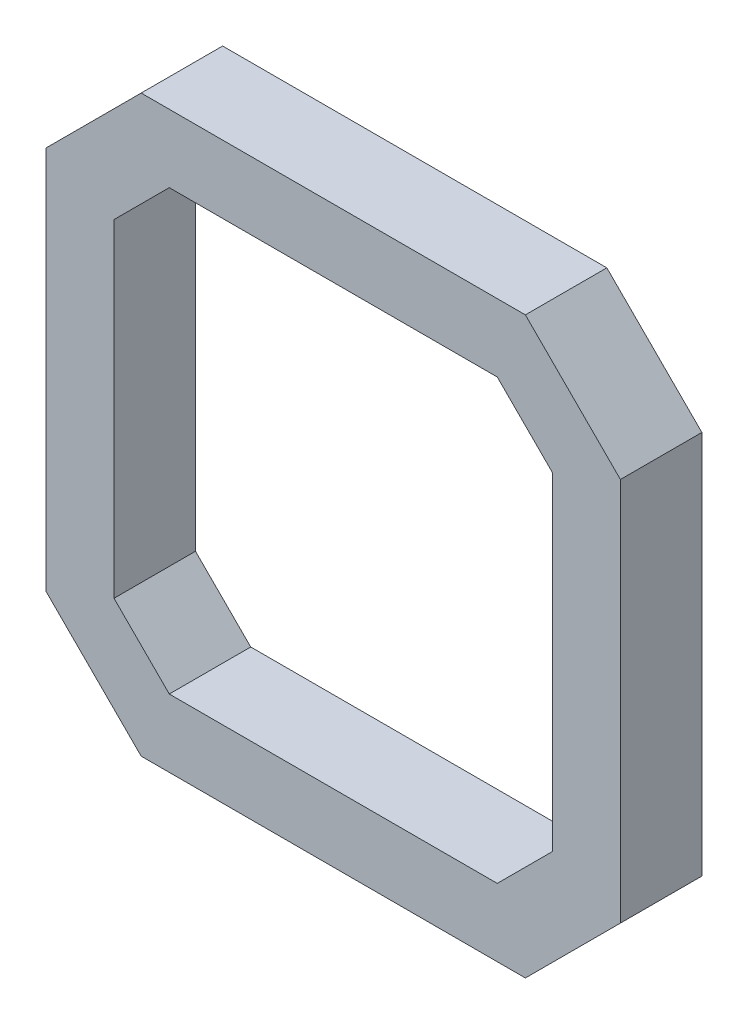
ISO-10303-21;
HEADER;
FILE_DESCRIPTION(('STEP AP214'),'2;1');
FILE_NAME('part.step','',(''),(''),'','','');
FILE_SCHEMA(('AUTOMOTIVE_DESIGN { 1 0 10303 214 1 1 1 1 }'));
ENDSEC;
DATA;
#1=APPLICATION_CONTEXT('core data for automotive mechanical design processes');
#2=APPLICATION_PROTOCOL_DEFINITION('international standard','automotive_design',2000,#1);
#3=PRODUCT_CONTEXT('',#1,'mechanical');
#4=PRODUCT('Part','Part','',(#3));
#5=PRODUCT_RELATED_PRODUCT_CATEGORY('part','',(#4));
#6=PRODUCT_DEFINITION_FORMATION('','',#4);
#7=PRODUCT_DEFINITION_CONTEXT('part definition',#1,'design');
#8=PRODUCT_DEFINITION('design','',#6,#7);
#9=PRODUCT_DEFINITION_SHAPE('','',#8);
#10=(LENGTH_UNIT() NAMED_UNIT(*) SI_UNIT(.MILLI.,.METRE.));
#11=(NAMED_UNIT(*) PLANE_ANGLE_UNIT() SI_UNIT($,.RADIAN.));
#12=(NAMED_UNIT(*) SI_UNIT($,.STERADIAN.) SOLID_ANGLE_UNIT());
#13=UNCERTAINTY_MEASURE_WITH_UNIT(LENGTH_MEASURE(1.E-05),#10,'distance_accuracy_value','');
#14=(GEOMETRIC_REPRESENTATION_CONTEXT(3) GLOBAL_UNCERTAINTY_ASSIGNED_CONTEXT((#13)) GLOBAL_UNIT_ASSIGNED_CONTEXT((#10,
#11,#12)) REPRESENTATION_CONTEXT('',''));
#15=CARTESIAN_POINT('',(0.,0.,0.));
#16=DIRECTION('',(0.,0.,1.));
#17=DIRECTION('',(1.,0.,0.));
#18=AXIS2_PLACEMENT_3D('',#15,#16,#17);
#19=CARTESIAN_POINT('',(0.,0.,6.));
#20=DIRECTION('',(0.,0.,-1.));
#21=DIRECTION('',(-1.,0.,0.));
#22=AXIS2_PLACEMENT_3D('',#19,#20,#21);
#23=PLANE('',#22);
#24=DIRECTION('',(0.,-1.,0.));
#25=VECTOR('',#24,1.);
#26=CARTESIAN_POINT('',(-21.15,-14.15,6.));
#27=LINE('',#26,#25);
#28=CARTESIAN_POINT('',(-21.15,14.15,6.));
#29=VERTEX_POINT('',#28);
#30=CARTESIAN_POINT('',(-21.15,-14.15,6.));
#31=VERTEX_POINT('',#30);
#32=EDGE_CURVE('E210',#29,#31,#27,.T.);
#33=ORIENTED_EDGE('',*,*,#32,.T.);
#34=DIRECTION('',(0.707106781186547,-0.707106781186547,0.));
#35=VECTOR('',#34,1.);
#36=CARTESIAN_POINT('',(-21.15,-14.15,6.));
#37=LINE('',#36,#35);
#38=CARTESIAN_POINT('',(-14.15,-21.15,6.));
#39=VERTEX_POINT('',#38);
#40=EDGE_CURVE('E213',#31,#39,#37,.T.);
#41=ORIENTED_EDGE('',*,*,#40,.T.);
#42=DIRECTION('',(1.,0.,0.));
#43=VECTOR('',#42,1.);
#44=CARTESIAN_POINT('',(-14.15,-21.15,6.));
#45=LINE('',#44,#43);
#46=CARTESIAN_POINT('',(14.15,-21.15,6.));
#47=VERTEX_POINT('',#46);
#48=EDGE_CURVE('E216',#39,#47,#45,.T.);
#49=ORIENTED_EDGE('',*,*,#48,.T.);
#50=DIRECTION('',(0.707106781186547,0.707106781186547,0.));
#51=VECTOR('',#50,1.);
#52=CARTESIAN_POINT('',(14.15,-21.15,6.));
#53=LINE('',#52,#51);
#54=CARTESIAN_POINT('',(21.15,-14.15,6.));
#55=VERTEX_POINT('',#54);
#56=EDGE_CURVE('E218',#47,#55,#53,.T.);
#57=ORIENTED_EDGE('',*,*,#56,.T.);
#58=DIRECTION('',(0.,1.,0.));
#59=VECTOR('',#58,1.);
#60=CARTESIAN_POINT('',(21.15,-14.15,6.));
#61=LINE('',#60,#59);
#62=CARTESIAN_POINT('',(21.15,14.15,6.));
#63=VERTEX_POINT('',#62);
#64=EDGE_CURVE('E220',#55,#63,#61,.T.);
#65=ORIENTED_EDGE('',*,*,#64,.T.);
#66=DIRECTION('',(-0.707106781186547,0.707106781186547,0.));
#67=VECTOR('',#66,1.);
#68=CARTESIAN_POINT('',(14.15,21.15,6.));
#69=LINE('',#68,#67);
#70=CARTESIAN_POINT('',(14.15,21.15,6.));
#71=VERTEX_POINT('',#70);
#72=EDGE_CURVE('E222',#63,#71,#69,.T.);
#73=ORIENTED_EDGE('',*,*,#72,.T.);
#74=DIRECTION('',(-1.,0.,0.));
#75=VECTOR('',#74,1.);
#76=CARTESIAN_POINT('',(-14.15,21.15,6.));
#77=LINE('',#76,#75);
#78=CARTESIAN_POINT('',(-14.15,21.15,6.));
#79=VERTEX_POINT('',#78);
#80=EDGE_CURVE('E224',#71,#79,#77,.T.);
#81=ORIENTED_EDGE('',*,*,#80,.T.);
#82=DIRECTION('',(-0.707106781186547,-0.707106781186547,0.));
#83=VECTOR('',#82,1.);
#84=CARTESIAN_POINT('',(-21.15,14.15,6.));
#85=LINE('',#84,#83);
#86=EDGE_CURVE('E226',#79,#29,#85,.T.);
#87=ORIENTED_EDGE('',*,*,#86,.T.);
#88=EDGE_LOOP('',(#33,#41,#49,#57,#65,#73,#81,#87));
#89=FACE_BOUND('',#88,.T.);
#90=DIRECTION('',(-0.707106781186547,-0.707106781186547,0.));
#91=VECTOR('',#90,1.);
#92=CARTESIAN_POINT('',(-16.15,12.0789321881345,6.));
#93=LINE('',#92,#91);
#94=CARTESIAN_POINT('',(-12.0789321881345,16.15,6.));
#95=VERTEX_POINT('',#94);
#96=CARTESIAN_POINT('',(-16.15,12.0789321881345,6.));
#97=VERTEX_POINT('',#96);
#98=EDGE_CURVE('E145',#95,#97,#93,.T.);
#99=ORIENTED_EDGE('',*,*,#98,.F.);
#100=DIRECTION('',(-1.,0.,0.));
#101=VECTOR('',#100,1.);
#102=CARTESIAN_POINT('',(-12.0789321881345,16.15,6.));
#103=LINE('',#102,#101);
#104=CARTESIAN_POINT('',(12.0789321881345,16.15,6.));
#105=VERTEX_POINT('',#104);
#106=EDGE_CURVE('E178',#105,#95,#103,.T.);
#107=ORIENTED_EDGE('',*,*,#106,.F.);
#108=DIRECTION('',(-0.707106781186547,0.707106781186547,0.));
#109=VECTOR('',#108,1.);
#110=CARTESIAN_POINT('',(12.0789321881345,16.15,6.));
#111=LINE('',#110,#109);
#112=CARTESIAN_POINT('',(16.15,12.0789321881345,6.));
#113=VERTEX_POINT('',#112);
#114=EDGE_CURVE('E176',#113,#105,#111,.T.);
#115=ORIENTED_EDGE('',*,*,#114,.F.);
#116=DIRECTION('',(0.,1.,0.));
#117=VECTOR('',#116,1.);
#118=CARTESIAN_POINT('',(16.15,-12.0789321881345,6.));
#119=LINE('',#118,#117);
#120=CARTESIAN_POINT('',(16.15,-12.0789321881345,6.));
#121=VERTEX_POINT('',#120);
#122=EDGE_CURVE('E174',#121,#113,#119,.T.);
#123=ORIENTED_EDGE('',*,*,#122,.F.);
#124=DIRECTION('',(0.707106781186547,0.707106781186547,0.));
#125=VECTOR('',#124,1.);
#126=CARTESIAN_POINT('',(12.0789321881345,-16.15,6.));
#127=LINE('',#126,#125);
#128=CARTESIAN_POINT('',(12.0789321881345,-16.15,6.));
#129=VERTEX_POINT('',#128);
#130=EDGE_CURVE('E172',#129,#121,#127,.T.);
#131=ORIENTED_EDGE('',*,*,#130,.F.);
#132=DIRECTION('',(1.,0.,0.));
#133=VECTOR('',#132,1.);
#134=CARTESIAN_POINT('',(-12.0789321881345,-16.15,6.));
#135=LINE('',#134,#133);
#136=CARTESIAN_POINT('',(-12.0789321881345,-16.15,6.));
#137=VERTEX_POINT('',#136);
#138=EDGE_CURVE('E168',#137,#129,#135,.T.);
#139=ORIENTED_EDGE('',*,*,#138,.F.);
#140=DIRECTION('',(0.707106781186547,-0.707106781186547,0.));
#141=VECTOR('',#140,1.);
#142=CARTESIAN_POINT('',(-16.15,-12.0789321881345,6.));
#143=LINE('',#142,#141);
#144=CARTESIAN_POINT('',(-16.15,-12.0789321881345,6.));
#145=VERTEX_POINT('',#144);
#146=EDGE_CURVE('E166',#145,#137,#143,.T.);
#147=ORIENTED_EDGE('',*,*,#146,.F.);
#148=DIRECTION('',(0.,-1.,0.));
#149=VECTOR('',#148,1.);
#150=CARTESIAN_POINT('',(-16.15,-12.0789321881345,6.));
#151=LINE('',#150,#149);
#152=EDGE_CURVE('E153',#97,#145,#151,.T.);
#153=ORIENTED_EDGE('',*,*,#152,.F.);
#154=EDGE_LOOP('',(#99,#107,#115,#123,#131,#139,#147,#153));
#155=FACE_BOUND('',#154,.T.);
#156=ADVANCED_FACE('F32',(#89,#155),#23,.F.);
#157=CARTESIAN_POINT('',(0.,0.,0.));
#158=DIRECTION('',(0.,0.,-1.));
#159=DIRECTION('',(-1.,0.,0.));
#160=AXIS2_PLACEMENT_3D('',#157,#158,#159);
#161=PLANE('',#160);
#162=DIRECTION('',(0.,-1.,0.));
#163=VECTOR('',#162,1.);
#164=CARTESIAN_POINT('',(-21.15,-14.15,0.));
#165=LINE('',#164,#163);
#166=CARTESIAN_POINT('',(-21.15,14.15,0.));
#167=VERTEX_POINT('',#166);
#168=CARTESIAN_POINT('',(-21.15,-14.15,0.));
#169=VERTEX_POINT('',#168);
#170=EDGE_CURVE('E161',#167,#169,#165,.T.);
#171=ORIENTED_EDGE('',*,*,#170,.F.);
#172=DIRECTION('',(-0.707106781186547,-0.707106781186547,0.));
#173=VECTOR('',#172,1.);
#174=CARTESIAN_POINT('',(-21.15,14.15,0.));
#175=LINE('',#174,#173);
#176=CARTESIAN_POINT('',(-14.15,21.15,0.));
#177=VERTEX_POINT('',#176);
#178=EDGE_CURVE('E214',#177,#167,#175,.T.);
#179=ORIENTED_EDGE('',*,*,#178,.F.);
#180=DIRECTION('',(-1.,0.,0.));
#181=VECTOR('',#180,1.);
#182=CARTESIAN_POINT('',(-14.15,21.15,0.));
#183=LINE('',#182,#181);
#184=CARTESIAN_POINT('',(14.15,21.15,0.));
#185=VERTEX_POINT('',#184);
#186=EDGE_CURVE('E241',#185,#177,#183,.T.);
#187=ORIENTED_EDGE('',*,*,#186,.F.);
#188=DIRECTION('',(-0.707106781186547,0.707106781186547,0.));
#189=VECTOR('',#188,1.);
#190=CARTESIAN_POINT('',(14.15,21.15,0.));
#191=LINE('',#190,#189);
#192=CARTESIAN_POINT('',(21.15,14.15,0.));
#193=VERTEX_POINT('',#192);
#194=EDGE_CURVE('E239',#193,#185,#191,.T.);
#195=ORIENTED_EDGE('',*,*,#194,.F.);
#196=DIRECTION('',(0.,1.,0.));
#197=VECTOR('',#196,1.);
#198=CARTESIAN_POINT('',(21.15,-14.15,0.));
#199=LINE('',#198,#197);
#200=CARTESIAN_POINT('',(21.15,-14.15,0.));
#201=VERTEX_POINT('',#200);
#202=EDGE_CURVE('E237',#201,#193,#199,.T.);
#203=ORIENTED_EDGE('',*,*,#202,.F.);
#204=DIRECTION('',(0.707106781186547,0.707106781186547,0.));
#205=VECTOR('',#204,1.);
#206=CARTESIAN_POINT('',(14.15,-21.15,0.));
#207=LINE('',#206,#205);
#208=CARTESIAN_POINT('',(14.15,-21.15,0.));
#209=VERTEX_POINT('',#208);
#210=EDGE_CURVE('E235',#209,#201,#207,.T.);
#211=ORIENTED_EDGE('',*,*,#210,.F.);
#212=DIRECTION('',(1.,0.,0.));
#213=VECTOR('',#212,1.);
#214=CARTESIAN_POINT('',(-14.15,-21.15,0.));
#215=LINE('',#214,#213);
#216=CARTESIAN_POINT('',(-14.15,-21.15,0.));
#217=VERTEX_POINT('',#216);
#218=EDGE_CURVE('E233',#217,#209,#215,.T.);
#219=ORIENTED_EDGE('',*,*,#218,.F.);
#220=DIRECTION('',(0.707106781186547,-0.707106781186547,0.));
#221=VECTOR('',#220,1.);
#222=CARTESIAN_POINT('',(-21.15,-14.15,0.));
#223=LINE('',#222,#221);
#224=EDGE_CURVE('E231',#169,#217,#223,.T.);
#225=ORIENTED_EDGE('',*,*,#224,.F.);
#226=EDGE_LOOP('',(#171,#179,#187,#195,#203,#211,#219,#225));
#227=FACE_BOUND('',#226,.T.);
#228=DIRECTION('',(-1.,0.,0.));
#229=VECTOR('',#228,1.);
#230=CARTESIAN_POINT('',(-12.0789321881345,16.15,0.));
#231=LINE('',#230,#229);
#232=CARTESIAN_POINT('',(12.0789321881345,16.15,0.));
#233=VERTEX_POINT('',#232);
#234=CARTESIAN_POINT('',(-12.0789321881345,16.15,0.));
#235=VERTEX_POINT('',#234);
#236=EDGE_CURVE('E154',#233,#235,#231,.T.);
#237=ORIENTED_EDGE('',*,*,#236,.T.);
#238=DIRECTION('',(-0.707106781186547,-0.707106781186547,0.));
#239=VECTOR('',#238,1.);
#240=CARTESIAN_POINT('',(-16.15,12.0789321881345,0.));
#241=LINE('',#240,#239);
#242=CARTESIAN_POINT('',(-16.15,12.0789321881345,0.));
#243=VERTEX_POINT('',#242);
#244=EDGE_CURVE('E55',#235,#243,#241,.T.);
#245=ORIENTED_EDGE('',*,*,#244,.T.);
#246=DIRECTION('',(0.,-1.,0.));
#247=VECTOR('',#246,1.);
#248=CARTESIAN_POINT('',(-16.15,-12.0789321881345,0.));
#249=LINE('',#248,#247);
#250=CARTESIAN_POINT('',(-16.15,-12.0789321881345,0.));
#251=VERTEX_POINT('',#250);
#252=EDGE_CURVE('E160',#243,#251,#249,.T.);
#253=ORIENTED_EDGE('',*,*,#252,.T.);
#254=DIRECTION('',(0.707106781186547,-0.707106781186547,0.));
#255=VECTOR('',#254,1.);
#256=CARTESIAN_POINT('',(-16.15,-12.0789321881345,0.));
#257=LINE('',#256,#255);
#258=CARTESIAN_POINT('',(-12.0789321881345,-16.15,0.));
#259=VERTEX_POINT('',#258);
#260=EDGE_CURVE('E182',#251,#259,#257,.T.);
#261=ORIENTED_EDGE('',*,*,#260,.T.);
#262=DIRECTION('',(1.,0.,0.));
#263=VECTOR('',#262,1.);
#264=CARTESIAN_POINT('',(-12.0789321881345,-16.15,0.));
#265=LINE('',#264,#263);
#266=CARTESIAN_POINT('',(12.0789321881345,-16.15,0.));
#267=VERTEX_POINT('',#266);
#268=EDGE_CURVE('E185',#259,#267,#265,.T.);
#269=ORIENTED_EDGE('',*,*,#268,.T.);
#270=DIRECTION('',(0.707106781186547,0.707106781186547,0.));
#271=VECTOR('',#270,1.);
#272=CARTESIAN_POINT('',(12.0789321881345,-16.15,0.));
#273=LINE('',#272,#271);
#274=CARTESIAN_POINT('',(16.15,-12.0789321881345,0.));
#275=VERTEX_POINT('',#274);
#276=EDGE_CURVE('E188',#267,#275,#273,.T.);
#277=ORIENTED_EDGE('',*,*,#276,.T.);
#278=DIRECTION('',(0.,1.,0.));
#279=VECTOR('',#278,1.);
#280=CARTESIAN_POINT('',(16.15,-12.0789321881345,0.));
#281=LINE('',#280,#279);
#282=CARTESIAN_POINT('',(16.15,12.0789321881345,0.));
#283=VERTEX_POINT('',#282);
#284=EDGE_CURVE('E191',#275,#283,#281,.T.);
#285=ORIENTED_EDGE('',*,*,#284,.T.);
#286=DIRECTION('',(-0.707106781186547,0.707106781186547,0.));
#287=VECTOR('',#286,1.);
#288=CARTESIAN_POINT('',(12.0789321881345,16.15,0.));
#289=LINE('',#288,#287);
#290=EDGE_CURVE('E194',#283,#233,#289,.T.);
#291=ORIENTED_EDGE('',*,*,#290,.T.);
#292=EDGE_LOOP('',(#237,#245,#253,#261,#269,#277,#285,#291));
#293=FACE_BOUND('',#292,.T.);
#294=ADVANCED_FACE('F271',(#227,#293),#161,.T.);
#295=CARTESIAN_POINT('',(-21.15,-14.15,6.));
#296=DIRECTION('',(1.,0.,0.));
#297=DIRECTION('',(0.,0.,-1.));
#298=AXIS2_PLACEMENT_3D('',#295,#296,#297);
#299=PLANE('',#298);
#300=ORIENTED_EDGE('',*,*,#170,.T.);
#301=DIRECTION('',(0.,0.,-1.));
#302=VECTOR('',#301,1.);
#303=CARTESIAN_POINT('',(-21.15,-14.15,6.));
#304=LINE('',#303,#302);
#305=EDGE_CURVE('E11',#31,#169,#304,.T.);
#306=ORIENTED_EDGE('',*,*,#305,.F.);
#307=ORIENTED_EDGE('',*,*,#32,.F.);
#308=DIRECTION('',(0.,0.,-1.));
#309=VECTOR('',#308,1.);
#310=CARTESIAN_POINT('',(-21.15,14.15,6.));
#311=LINE('',#310,#309);
#312=EDGE_CURVE('E228',#29,#167,#311,.T.);
#313=ORIENTED_EDGE('',*,*,#312,.T.);
#314=EDGE_LOOP('',(#300,#306,#307,#313));
#315=FACE_BOUND('',#314,.T.);
#316=ADVANCED_FACE('F34',(#315),#299,.F.);
#317=CARTESIAN_POINT('',(-21.15,-14.15,6.));
#318=DIRECTION('',(0.707106781186548,0.707106781186548,0.));
#319=DIRECTION('',(-0.707106781186548,0.707106781186548,0.));
#320=AXIS2_PLACEMENT_3D('',#317,#318,#319);
#321=PLANE('',#320);
#322=ORIENTED_EDGE('',*,*,#224,.T.);
#323=DIRECTION('',(0.,0.,-1.));
#324=VECTOR('',#323,1.);
#325=CARTESIAN_POINT('',(-14.15,-21.15,6.));
#326=LINE('',#325,#324);
#327=EDGE_CURVE('E40',#39,#217,#326,.T.);
#328=ORIENTED_EDGE('',*,*,#327,.F.);
#329=ORIENTED_EDGE('',*,*,#40,.F.);
#330=ORIENTED_EDGE('',*,*,#305,.T.);
#331=EDGE_LOOP('',(#322,#328,#329,#330));
#332=FACE_BOUND('',#331,.T.);
#333=ADVANCED_FACE('F288',(#332),#321,.F.);
#334=CARTESIAN_POINT('',(-14.15,-21.15,6.));
#335=DIRECTION('',(0.,1.,0.));
#336=DIRECTION('',(0.,0.,1.));
#337=AXIS2_PLACEMENT_3D('',#334,#335,#336);
#338=PLANE('',#337);
#339=ORIENTED_EDGE('',*,*,#218,.T.);
#340=DIRECTION('',(0.,0.,-1.));
#341=VECTOR('',#340,1.);
#342=CARTESIAN_POINT('',(14.15,-21.15,6.));
#343=LINE('',#342,#341);
#344=EDGE_CURVE('E258',#47,#209,#343,.T.);
#345=ORIENTED_EDGE('',*,*,#344,.F.);
#346=ORIENTED_EDGE('',*,*,#48,.F.);
#347=ORIENTED_EDGE('',*,*,#327,.T.);
#348=EDGE_LOOP('',(#339,#345,#346,#347));
#349=FACE_BOUND('',#348,.T.);
#350=ADVANCED_FACE('F265',(#349),#338,.F.);
#351=CARTESIAN_POINT('',(14.15,-21.15,6.));
#352=DIRECTION('',(-0.707106781186548,0.707106781186548,0.));
#353=DIRECTION('',(-0.707106781186548,-0.707106781186548,0.));
#354=AXIS2_PLACEMENT_3D('',#351,#352,#353);
#355=PLANE('',#354);
#356=ORIENTED_EDGE('',*,*,#210,.T.);
#357=DIRECTION('',(0.,0.,-1.));
#358=VECTOR('',#357,1.);
#359=CARTESIAN_POINT('',(21.15,-14.15,6.));
#360=LINE('',#359,#358);
#361=EDGE_CURVE('E255',#55,#201,#360,.T.);
#362=ORIENTED_EDGE('',*,*,#361,.F.);
#363=ORIENTED_EDGE('',*,*,#56,.F.);
#364=ORIENTED_EDGE('',*,*,#344,.T.);
#365=EDGE_LOOP('',(#356,#362,#363,#364));
#366=FACE_BOUND('',#365,.T.);
#367=ADVANCED_FACE('F277',(#366),#355,.F.);
#368=CARTESIAN_POINT('',(21.15,-14.15,6.));
#369=DIRECTION('',(-1.,0.,0.));
#370=DIRECTION('',(0.,0.,1.));
#371=AXIS2_PLACEMENT_3D('',#368,#369,#370);
#372=PLANE('',#371);
#373=ORIENTED_EDGE('',*,*,#202,.T.);
#374=DIRECTION('',(0.,0.,-1.));
#375=VECTOR('',#374,1.);
#376=CARTESIAN_POINT('',(21.15,14.15,6.));
#377=LINE('',#376,#375);
#378=EDGE_CURVE('E252',#63,#193,#377,.T.);
#379=ORIENTED_EDGE('',*,*,#378,.F.);
#380=ORIENTED_EDGE('',*,*,#64,.F.);
#381=ORIENTED_EDGE('',*,*,#361,.T.);
#382=EDGE_LOOP('',(#373,#379,#380,#381));
#383=FACE_BOUND('',#382,.T.);
#384=ADVANCED_FACE('F281',(#383),#372,.F.);
#385=CARTESIAN_POINT('',(14.15,21.15,6.));
#386=DIRECTION('',(-0.707106781186548,-0.707106781186548,0.));
#387=DIRECTION('',(0.707106781186548,-0.707106781186548,0.));
#388=AXIS2_PLACEMENT_3D('',#385,#386,#387);
#389=PLANE('',#388);
#390=ORIENTED_EDGE('',*,*,#194,.T.);
#391=DIRECTION('',(0.,0.,-1.));
#392=VECTOR('',#391,1.);
#393=CARTESIAN_POINT('',(14.15,21.15,6.));
#394=LINE('',#393,#392);
#395=EDGE_CURVE('E249',#71,#185,#394,.T.);
#396=ORIENTED_EDGE('',*,*,#395,.F.);
#397=ORIENTED_EDGE('',*,*,#72,.F.);
#398=ORIENTED_EDGE('',*,*,#378,.T.);
#399=EDGE_LOOP('',(#390,#396,#397,#398));
#400=FACE_BOUND('',#399,.T.);
#401=ADVANCED_FACE('F301',(#400),#389,.F.);
#402=CARTESIAN_POINT('',(-14.15,21.15,6.));
#403=DIRECTION('',(0.,-1.,0.));
#404=DIRECTION('',(0.,0.,-1.));
#405=AXIS2_PLACEMENT_3D('',#402,#403,#404);
#406=PLANE('',#405);
#407=ORIENTED_EDGE('',*,*,#186,.T.);
#408=DIRECTION('',(0.,0.,-1.));
#409=VECTOR('',#408,1.);
#410=CARTESIAN_POINT('',(-14.15,21.15,6.));
#411=LINE('',#410,#409);
#412=EDGE_CURVE('E246',#79,#177,#411,.T.);
#413=ORIENTED_EDGE('',*,*,#412,.F.);
#414=ORIENTED_EDGE('',*,*,#80,.F.);
#415=ORIENTED_EDGE('',*,*,#395,.T.);
#416=EDGE_LOOP('',(#407,#413,#414,#415));
#417=FACE_BOUND('',#416,.T.);
#418=ADVANCED_FACE('F299',(#417),#406,.F.);
#419=CARTESIAN_POINT('',(-21.15,14.15,6.));
#420=DIRECTION('',(0.707106781186548,-0.707106781186548,0.));
#421=DIRECTION('',(0.707106781186548,0.707106781186548,0.));
#422=AXIS2_PLACEMENT_3D('',#419,#420,#421);
#423=PLANE('',#422);
#424=ORIENTED_EDGE('',*,*,#178,.T.);
#425=ORIENTED_EDGE('',*,*,#312,.F.);
#426=ORIENTED_EDGE('',*,*,#86,.F.);
#427=ORIENTED_EDGE('',*,*,#412,.T.);
#428=EDGE_LOOP('',(#424,#425,#426,#427));
#429=FACE_BOUND('',#428,.T.);
#430=ADVANCED_FACE('F294',(#429),#423,.F.);
#431=CARTESIAN_POINT('',(-16.15,12.0789321881345,6.));
#432=DIRECTION('',(0.707106781186548,-0.707106781186548,0.));
#433=DIRECTION('',(0.707106781186548,0.707106781186548,0.));
#434=AXIS2_PLACEMENT_3D('',#431,#432,#433);
#435=PLANE('',#434);
#436=ORIENTED_EDGE('',*,*,#244,.F.);
#437=DIRECTION('',(0.,0.,-1.));
#438=VECTOR('',#437,1.);
#439=CARTESIAN_POINT('',(-12.0789321881345,16.15,6.));
#440=LINE('',#439,#438);
#441=EDGE_CURVE('E149',#95,#235,#440,.T.);
#442=ORIENTED_EDGE('',*,*,#441,.F.);
#443=ORIENTED_EDGE('',*,*,#98,.T.);
#444=DIRECTION('',(0.,0.,-1.));
#445=VECTOR('',#444,1.);
#446=CARTESIAN_POINT('',(-16.15,12.0789321881345,6.));
#447=LINE('',#446,#445);
#448=EDGE_CURVE('E148',#97,#243,#447,.T.);
#449=ORIENTED_EDGE('',*,*,#448,.T.);
#450=EDGE_LOOP('',(#436,#442,#443,#449));
#451=FACE_BOUND('',#450,.T.);
#452=ADVANCED_FACE('F147',(#451),#435,.T.);
#453=CARTESIAN_POINT('',(-16.15,-12.0789321881345,6.));
#454=DIRECTION('',(1.,0.,0.));
#455=DIRECTION('',(0.,0.,-1.));
#456=AXIS2_PLACEMENT_3D('',#453,#454,#455);
#457=PLANE('',#456);
#458=ORIENTED_EDGE('',*,*,#252,.F.);
#459=ORIENTED_EDGE('',*,*,#448,.F.);
#460=ORIENTED_EDGE('',*,*,#152,.T.);
#461=DIRECTION('',(0.,0.,-1.));
#462=VECTOR('',#461,1.);
#463=CARTESIAN_POINT('',(-16.15,-12.0789321881345,6.));
#464=LINE('',#463,#462);
#465=EDGE_CURVE('E162',#145,#251,#464,.T.);
#466=ORIENTED_EDGE('',*,*,#465,.T.);
#467=EDGE_LOOP('',(#458,#459,#460,#466));
#468=FACE_BOUND('',#467,.T.);
#469=ADVANCED_FACE('F157',(#468),#457,.T.);
#470=CARTESIAN_POINT('',(-16.15,-12.0789321881345,6.));
#471=DIRECTION('',(0.707106781186548,0.707106781186548,0.));
#472=DIRECTION('',(-0.707106781186548,0.707106781186548,0.));
#473=AXIS2_PLACEMENT_3D('',#470,#471,#472);
#474=PLANE('',#473);
#475=ORIENTED_EDGE('',*,*,#260,.F.);
#476=ORIENTED_EDGE('',*,*,#465,.F.);
#477=ORIENTED_EDGE('',*,*,#146,.T.);
#478=DIRECTION('',(0.,0.,-1.));
#479=VECTOR('',#478,1.);
#480=CARTESIAN_POINT('',(-12.0789321881345,-16.15,6.));
#481=LINE('',#480,#479);
#482=EDGE_CURVE('E207',#137,#259,#481,.T.);
#483=ORIENTED_EDGE('',*,*,#482,.T.);
#484=EDGE_LOOP('',(#475,#476,#477,#483));
#485=FACE_BOUND('',#484,.T.);
#486=ADVANCED_FACE('F326',(#485),#474,.T.);
#487=CARTESIAN_POINT('',(-12.0789321881345,-16.15,6.));
#488=DIRECTION('',(0.,1.,0.));
#489=DIRECTION('',(0.,0.,1.));
#490=AXIS2_PLACEMENT_3D('',#487,#488,#489);
#491=PLANE('',#490);
#492=ORIENTED_EDGE('',*,*,#268,.F.);
#493=ORIENTED_EDGE('',*,*,#482,.F.);
#494=ORIENTED_EDGE('',*,*,#138,.T.);
#495=DIRECTION('',(0.,0.,-1.));
#496=VECTOR('',#495,1.);
#497=CARTESIAN_POINT('',(12.0789321881345,-16.15,6.));
#498=LINE('',#497,#496);
#499=EDGE_CURVE('E205',#129,#267,#498,.T.);
#500=ORIENTED_EDGE('',*,*,#499,.T.);
#501=EDGE_LOOP('',(#492,#493,#494,#500));
#502=FACE_BOUND('',#501,.T.);
#503=ADVANCED_FACE('F330',(#502),#491,.T.);
#504=CARTESIAN_POINT('',(12.0789321881345,-16.15,6.));
#505=DIRECTION('',(-0.707106781186548,0.707106781186548,0.));
#506=DIRECTION('',(-0.707106781186548,-0.707106781186548,0.));
#507=AXIS2_PLACEMENT_3D('',#504,#505,#506);
#508=PLANE('',#507);
#509=ORIENTED_EDGE('',*,*,#276,.F.);
#510=ORIENTED_EDGE('',*,*,#499,.F.);
#511=ORIENTED_EDGE('',*,*,#130,.T.);
#512=DIRECTION('',(0.,0.,-1.));
#513=VECTOR('',#512,1.);
#514=CARTESIAN_POINT('',(16.15,-12.0789321881345,6.));
#515=LINE('',#514,#513);
#516=EDGE_CURVE('E203',#121,#275,#515,.T.);
#517=ORIENTED_EDGE('',*,*,#516,.T.);
#518=EDGE_LOOP('',(#509,#510,#511,#517));
#519=FACE_BOUND('',#518,.T.);
#520=ADVANCED_FACE('F336',(#519),#508,.T.);
#521=CARTESIAN_POINT('',(16.15,-12.0789321881345,6.));
#522=DIRECTION('',(-1.,0.,0.));
#523=DIRECTION('',(0.,0.,1.));
#524=AXIS2_PLACEMENT_3D('',#521,#522,#523);
#525=PLANE('',#524);
#526=ORIENTED_EDGE('',*,*,#284,.F.);
#527=ORIENTED_EDGE('',*,*,#516,.F.);
#528=ORIENTED_EDGE('',*,*,#122,.T.);
#529=DIRECTION('',(0.,0.,-1.));
#530=VECTOR('',#529,1.);
#531=CARTESIAN_POINT('',(16.15,12.0789321881345,6.));
#532=LINE('',#531,#530);
#533=EDGE_CURVE('E201',#113,#283,#532,.T.);
#534=ORIENTED_EDGE('',*,*,#533,.T.);
#535=EDGE_LOOP('',(#526,#527,#528,#534));
#536=FACE_BOUND('',#535,.T.);
#537=ADVANCED_FACE('F340',(#536),#525,.T.);
#538=CARTESIAN_POINT('',(12.0789321881345,16.15,6.));
#539=DIRECTION('',(-0.707106781186548,-0.707106781186548,0.));
#540=DIRECTION('',(0.707106781186548,-0.707106781186548,0.));
#541=AXIS2_PLACEMENT_3D('',#538,#539,#540);
#542=PLANE('',#541);
#543=ORIENTED_EDGE('',*,*,#290,.F.);
#544=ORIENTED_EDGE('',*,*,#533,.F.);
#545=ORIENTED_EDGE('',*,*,#114,.T.);
#546=DIRECTION('',(0.,0.,-1.));
#547=VECTOR('',#546,1.);
#548=CARTESIAN_POINT('',(12.0789321881345,16.15,6.));
#549=LINE('',#548,#547);
#550=EDGE_CURVE('E47',#105,#233,#549,.T.);
#551=ORIENTED_EDGE('',*,*,#550,.T.);
#552=EDGE_LOOP('',(#543,#544,#545,#551));
#553=FACE_BOUND('',#552,.T.);
#554=ADVANCED_FACE('F344',(#553),#542,.T.);
#555=CARTESIAN_POINT('',(-12.0789321881345,16.15,6.));
#556=DIRECTION('',(0.,-1.,0.));
#557=DIRECTION('',(0.,0.,-1.));
#558=AXIS2_PLACEMENT_3D('',#555,#556,#557);
#559=PLANE('',#558);
#560=ORIENTED_EDGE('',*,*,#236,.F.);
#561=ORIENTED_EDGE('',*,*,#550,.F.);
#562=ORIENTED_EDGE('',*,*,#106,.T.);
#563=ORIENTED_EDGE('',*,*,#441,.T.);
#564=EDGE_LOOP('',(#560,#561,#562,#563));
#565=FACE_BOUND('',#564,.T.);
#566=ADVANCED_FACE('F348',(#565),#559,.T.);
#567=CLOSED_SHELL('',(#156,#294,#316,#333,#350,#367,#384,#401,#418,#430,#452,#469,#486,#503,
#520,#537,#554,#566));
#568=MANIFOLD_SOLID_BREP('B2',#567);
#569=ADVANCED_BREP_SHAPE_REPRESENTATION('',(#18,#568),#14);
#570=SHAPE_DEFINITION_REPRESENTATION(#9,#569);
ENDSEC;
END-ISO-10303-21;
